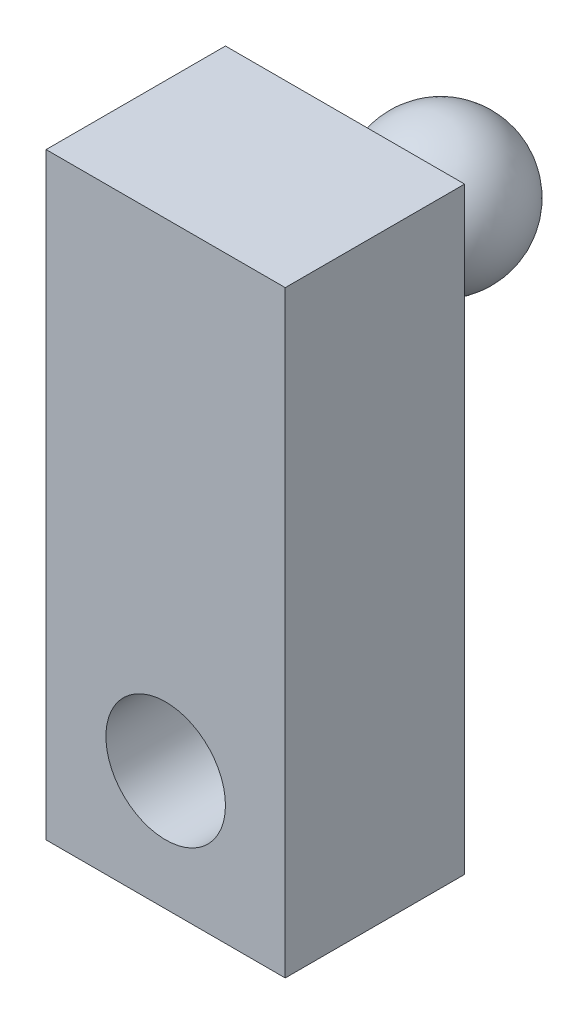
ISO-10303-21;
HEADER;
FILE_DESCRIPTION(('STEP AP214'),'2;1');
FILE_NAME('part.step','',(''),(''),'','','');
FILE_SCHEMA(('AUTOMOTIVE_DESIGN { 1 0 10303 214 1 1 1 1 }'));
ENDSEC;
DATA;
#1=APPLICATION_CONTEXT('core data for automotive mechanical design processes');
#2=APPLICATION_PROTOCOL_DEFINITION('international standard','automotive_design',2000,#1);
#3=PRODUCT_CONTEXT('',#1,'mechanical');
#4=PRODUCT('Part','Part','',(#3));
#5=PRODUCT_RELATED_PRODUCT_CATEGORY('part','',(#4));
#6=PRODUCT_DEFINITION_FORMATION('','',#4);
#7=PRODUCT_DEFINITION_CONTEXT('part definition',#1,'design');
#8=PRODUCT_DEFINITION('design','',#6,#7);
#9=PRODUCT_DEFINITION_SHAPE('','',#8);
#10=(LENGTH_UNIT() NAMED_UNIT(*) SI_UNIT(.MILLI.,.METRE.));
#11=(NAMED_UNIT(*) PLANE_ANGLE_UNIT() SI_UNIT($,.RADIAN.));
#12=(NAMED_UNIT(*) SI_UNIT($,.STERADIAN.) SOLID_ANGLE_UNIT());
#13=UNCERTAINTY_MEASURE_WITH_UNIT(LENGTH_MEASURE(1.E-05),#10,'distance_accuracy_value','');
#14=(GEOMETRIC_REPRESENTATION_CONTEXT(3) GLOBAL_UNCERTAINTY_ASSIGNED_CONTEXT((#13)) GLOBAL_UNIT_ASSIGNED_CONTEXT((#10,
#11,#12)) REPRESENTATION_CONTEXT('',''));
#15=CARTESIAN_POINT('',(0.,0.,0.));
#16=DIRECTION('',(0.,0.,1.));
#17=DIRECTION('',(1.,0.,0.));
#18=AXIS2_PLACEMENT_3D('',#15,#16,#17);
#19=CARTESIAN_POINT('',(12.7,50.8,-10.16));
#20=DIRECTION('',(0.,1.,0.));
#21=DIRECTION('',(-1.,0.,0.));
#22=AXIS2_PLACEMENT_3D('',#19,#20,#21);
#23=SPHERICAL_SURFACE('',#22,7.62);
#24=CARTESIAN_POINT('',(12.7,58.42,-10.16));
#25=VERTEX_POINT('',#24);
#26=VERTEX_LOOP('',#25);
#27=FACE_BOUND('',#26,.T.);
#28=ADVANCED_FACE('F39',(#27),#23,.T.);
#29=CLOSED_SHELL('',(#28));
#30=MANIFOLD_SOLID_BREP('B2',#29);
#31=CARTESIAN_POINT('',(0.,0.,19.05));
#32=DIRECTION('',(0.,0.,-1.));
#33=DIRECTION('',(-1.,0.,0.));
#34=AXIS2_PLACEMENT_3D('',#31,#32,#33);
#35=PLANE('',#34);
#36=DIRECTION('',(0.,-1.,0.));
#37=VECTOR('',#36,1.);
#38=CARTESIAN_POINT('',(0.,0.,19.05));
#39=LINE('',#38,#37);
#40=CARTESIAN_POINT('',(0.,63.5,19.05));
#41=VERTEX_POINT('',#40);
#42=CARTESIAN_POINT('',(0.,0.,19.05));
#43=VERTEX_POINT('',#42);
#44=EDGE_CURVE('E104',#41,#43,#39,.T.);
#45=ORIENTED_EDGE('',*,*,#44,.T.);
#46=DIRECTION('',(1.,0.,0.));
#47=VECTOR('',#46,1.);
#48=CARTESIAN_POINT('',(0.,0.,19.05));
#49=LINE('',#48,#47);
#50=CARTESIAN_POINT('',(25.4,0.,19.05));
#51=VERTEX_POINT('',#50);
#52=EDGE_CURVE('E99',#43,#51,#49,.T.);
#53=ORIENTED_EDGE('',*,*,#52,.T.);
#54=DIRECTION('',(0.,1.,0.));
#55=VECTOR('',#54,1.);
#56=CARTESIAN_POINT('',(25.4,0.,19.05));
#57=LINE('',#56,#55);
#58=CARTESIAN_POINT('',(25.4,63.5,19.05));
#59=VERTEX_POINT('',#58);
#60=EDGE_CURVE('E102',#51,#59,#57,.T.);
#61=ORIENTED_EDGE('',*,*,#60,.T.);
#62=DIRECTION('',(-1.,0.,0.));
#63=VECTOR('',#62,1.);
#64=CARTESIAN_POINT('',(0.,63.5,19.05));
#65=LINE('',#64,#63);
#66=EDGE_CURVE('E69',#59,#41,#65,.T.);
#67=ORIENTED_EDGE('',*,*,#66,.T.);
#68=EDGE_LOOP('',(#45,#53,#61,#67));
#69=FACE_BOUND('',#68,.T.);
#70=CARTESIAN_POINT('',(12.7,12.7,19.05));
#71=DIRECTION('',(0.,0.,1.));
#72=DIRECTION('',(1.,0.,0.));
#73=AXIS2_PLACEMENT_3D('',#70,#71,#72);
#74=CIRCLE('',#73,6.35);
#75=CARTESIAN_POINT('',(19.05,12.7,19.05));
#76=VERTEX_POINT('',#75);
#77=EDGE_CURVE('E119',#76,#76,#74,.T.);
#78=ORIENTED_EDGE('',*,*,#77,.F.);
#79=EDGE_LOOP('',(#78));
#80=FACE_BOUND('',#79,.T.);
#81=ADVANCED_FACE('F52',(#69,#80),#35,.F.);
#82=CARTESIAN_POINT('',(0.,0.,0.));
#83=DIRECTION('',(0.,0.,-1.));
#84=DIRECTION('',(-1.,0.,0.));
#85=AXIS2_PLACEMENT_3D('',#82,#83,#84);
#86=PLANE('',#85);
#87=CARTESIAN_POINT('',(12.7,50.8,0.));
#88=DIRECTION('',(0.,0.,-1.));
#89=DIRECTION('',(-1.,0.,0.));
#90=AXIS2_PLACEMENT_3D('',#87,#88,#89);
#91=CIRCLE('',#90,6.35);
#92=CARTESIAN_POINT('',(6.35,50.8,0.));
#93=VERTEX_POINT('',#92);
#94=EDGE_CURVE('E137',#93,#93,#91,.T.);
#95=ORIENTED_EDGE('',*,*,#94,.F.);
#96=EDGE_LOOP('',(#95));
#97=FACE_BOUND('',#96,.T.);
#98=DIRECTION('',(0.,-1.,0.));
#99=VECTOR('',#98,1.);
#100=CARTESIAN_POINT('',(0.,0.,0.));
#101=LINE('',#100,#99);
#102=CARTESIAN_POINT('',(0.,63.5,0.));
#103=VERTEX_POINT('',#102);
#104=CARTESIAN_POINT('',(0.,0.,0.));
#105=VERTEX_POINT('',#104);
#106=EDGE_CURVE('E116',#103,#105,#101,.T.);
#107=ORIENTED_EDGE('',*,*,#106,.F.);
#108=DIRECTION('',(-1.,0.,0.));
#109=VECTOR('',#108,1.);
#110=CARTESIAN_POINT('',(0.,63.5,0.));
#111=LINE('',#110,#109);
#112=CARTESIAN_POINT('',(25.4,63.5,0.));
#113=VERTEX_POINT('',#112);
#114=EDGE_CURVE('E92',#113,#103,#111,.T.);
#115=ORIENTED_EDGE('',*,*,#114,.F.);
#116=DIRECTION('',(0.,1.,0.));
#117=VECTOR('',#116,1.);
#118=CARTESIAN_POINT('',(25.4,0.,0.));
#119=LINE('',#118,#117);
#120=CARTESIAN_POINT('',(25.4,0.,0.));
#121=VERTEX_POINT('',#120);
#122=EDGE_CURVE('E86',#121,#113,#119,.T.);
#123=ORIENTED_EDGE('',*,*,#122,.F.);
#124=DIRECTION('',(1.,0.,0.));
#125=VECTOR('',#124,1.);
#126=CARTESIAN_POINT('',(0.,0.,0.));
#127=LINE('',#126,#125);
#128=EDGE_CURVE('E108',#105,#121,#127,.T.);
#129=ORIENTED_EDGE('',*,*,#128,.F.);
#130=EDGE_LOOP('',(#107,#115,#123,#129));
#131=FACE_BOUND('',#130,.T.);
#132=CARTESIAN_POINT('',(12.7,12.7,0.));
#133=DIRECTION('',(0.,0.,1.));
#134=DIRECTION('',(1.,0.,0.));
#135=AXIS2_PLACEMENT_3D('',#132,#133,#134);
#136=CIRCLE('',#135,6.35);
#137=CARTESIAN_POINT('',(19.05,12.7,0.));
#138=VERTEX_POINT('',#137);
#139=EDGE_CURVE('E131',#138,#138,#136,.T.);
#140=ORIENTED_EDGE('',*,*,#139,.T.);
#141=EDGE_LOOP('',(#140));
#142=FACE_BOUND('',#141,.T.);
#143=ADVANCED_FACE('F127',(#97,#131,#142),#86,.T.);
#144=CARTESIAN_POINT('',(0.,0.,19.05));
#145=DIRECTION('',(1.,0.,0.));
#146=DIRECTION('',(0.,0.,-1.));
#147=AXIS2_PLACEMENT_3D('',#144,#145,#146);
#148=PLANE('',#147);
#149=ORIENTED_EDGE('',*,*,#106,.T.);
#150=DIRECTION('',(0.,0.,-1.));
#151=VECTOR('',#150,1.);
#152=CARTESIAN_POINT('',(0.,0.,19.05));
#153=LINE('',#152,#151);
#154=EDGE_CURVE('E37',#43,#105,#153,.T.);
#155=ORIENTED_EDGE('',*,*,#154,.F.);
#156=ORIENTED_EDGE('',*,*,#44,.F.);
#157=DIRECTION('',(0.,0.,-1.));
#158=VECTOR('',#157,1.);
#159=CARTESIAN_POINT('',(0.,63.5,19.05));
#160=LINE('',#159,#158);
#161=EDGE_CURVE('E112',#41,#103,#160,.T.);
#162=ORIENTED_EDGE('',*,*,#161,.T.);
#163=EDGE_LOOP('',(#149,#155,#156,#162));
#164=FACE_BOUND('',#163,.T.);
#165=ADVANCED_FACE('F54',(#164),#148,.F.);
#166=CARTESIAN_POINT('',(0.,0.,19.05));
#167=DIRECTION('',(0.,1.,0.));
#168=DIRECTION('',(0.,0.,1.));
#169=AXIS2_PLACEMENT_3D('',#166,#167,#168);
#170=PLANE('',#169);
#171=ORIENTED_EDGE('',*,*,#128,.T.);
#172=DIRECTION('',(0.,0.,-1.));
#173=VECTOR('',#172,1.);
#174=CARTESIAN_POINT('',(25.4,0.,19.05));
#175=LINE('',#174,#173);
#176=EDGE_CURVE('E61',#51,#121,#175,.T.);
#177=ORIENTED_EDGE('',*,*,#176,.F.);
#178=ORIENTED_EDGE('',*,*,#52,.F.);
#179=ORIENTED_EDGE('',*,*,#154,.T.);
#180=EDGE_LOOP('',(#171,#177,#178,#179));
#181=FACE_BOUND('',#180,.T.);
#182=ADVANCED_FACE('F107',(#181),#170,.F.);
#183=CARTESIAN_POINT('',(25.4,0.,19.05));
#184=DIRECTION('',(-1.,0.,0.));
#185=DIRECTION('',(0.,0.,1.));
#186=AXIS2_PLACEMENT_3D('',#183,#184,#185);
#187=PLANE('',#186);
#188=ORIENTED_EDGE('',*,*,#122,.T.);
#189=DIRECTION('',(0.,0.,-1.));
#190=VECTOR('',#189,1.);
#191=CARTESIAN_POINT('',(25.4,63.5,19.05));
#192=LINE('',#191,#190);
#193=EDGE_CURVE('E109',#59,#113,#192,.T.);
#194=ORIENTED_EDGE('',*,*,#193,.F.);
#195=ORIENTED_EDGE('',*,*,#60,.F.);
#196=ORIENTED_EDGE('',*,*,#176,.T.);
#197=EDGE_LOOP('',(#188,#194,#195,#196));
#198=FACE_BOUND('',#197,.T.);
#199=ADVANCED_FACE('F110',(#198),#187,.F.);
#200=CARTESIAN_POINT('',(0.,63.5,19.05));
#201=DIRECTION('',(0.,-1.,0.));
#202=DIRECTION('',(0.,0.,-1.));
#203=AXIS2_PLACEMENT_3D('',#200,#201,#202);
#204=PLANE('',#203);
#205=ORIENTED_EDGE('',*,*,#114,.T.);
#206=ORIENTED_EDGE('',*,*,#161,.F.);
#207=ORIENTED_EDGE('',*,*,#66,.F.);
#208=ORIENTED_EDGE('',*,*,#193,.T.);
#209=EDGE_LOOP('',(#205,#206,#207,#208));
#210=FACE_BOUND('',#209,.T.);
#211=ADVANCED_FACE('F124',(#210),#204,.F.);
#212=CARTESIAN_POINT('',(12.7,12.7,19.05));
#213=DIRECTION('',(0.,0.,-1.));
#214=DIRECTION('',(-1.,0.,0.));
#215=AXIS2_PLACEMENT_3D('',#212,#213,#214);
#216=CYLINDRICAL_SURFACE('',#215,6.35);
#217=ORIENTED_EDGE('',*,*,#77,.T.);
#218=EDGE_LOOP('',(#217));
#219=FACE_BOUND('',#218,.T.);
#220=ORIENTED_EDGE('',*,*,#139,.F.);
#221=EDGE_LOOP('',(#220));
#222=FACE_BOUND('',#221,.T.);
#223=ADVANCED_FACE('F148',(#219,#222),#216,.F.);
#224=CARTESIAN_POINT('',(12.7,50.8,-2.54));
#225=DIRECTION('',(0.,0.,1.));
#226=DIRECTION('',(1.,0.,0.));
#227=AXIS2_PLACEMENT_3D('',#224,#225,#226);
#228=CYLINDRICAL_SURFACE('',#227,6.35);
#229=CARTESIAN_POINT('',(12.7,50.8,-2.54));
#230=DIRECTION('',(0.,0.,-1.));
#231=DIRECTION('',(-1.,0.,0.));
#232=AXIS2_PLACEMENT_3D('',#229,#230,#231);
#233=CIRCLE('',#232,6.35);
#234=CARTESIAN_POINT('',(6.35,50.8,-2.54));
#235=VERTEX_POINT('',#234);
#236=EDGE_CURVE('E134',#235,#235,#233,.T.);
#237=ORIENTED_EDGE('',*,*,#236,.F.);
#238=EDGE_LOOP('',(#237));
#239=FACE_BOUND('',#238,.T.);
#240=ORIENTED_EDGE('',*,*,#94,.T.);
#241=EDGE_LOOP('',(#240));
#242=FACE_BOUND('',#241,.T.);
#243=ADVANCED_FACE('F145',(#239,#242),#228,.T.);
#244=CARTESIAN_POINT('',(12.7,50.8,-2.54));
#245=DIRECTION('',(0.,0.,-1.));
#246=DIRECTION('',(-1.,0.,0.));
#247=AXIS2_PLACEMENT_3D('',#244,#245,#246);
#248=PLANE('',#247);
#249=ORIENTED_EDGE('',*,*,#236,.T.);
#250=EDGE_LOOP('',(#249));
#251=FACE_BOUND('',#250,.T.);
#252=ADVANCED_FACE('F143',(#251),#248,.T.);
#253=CLOSED_SHELL('',(#81,#143,#165,#182,#199,#211,#223,#243,#252));
#254=MANIFOLD_SOLID_BREP('B6',#253);
#255=ADVANCED_BREP_SHAPE_REPRESENTATION('',(#18,#30,#254),#14);
#256=SHAPE_DEFINITION_REPRESENTATION(#9,#255);
ENDSEC;
END-ISO-10303-21;
